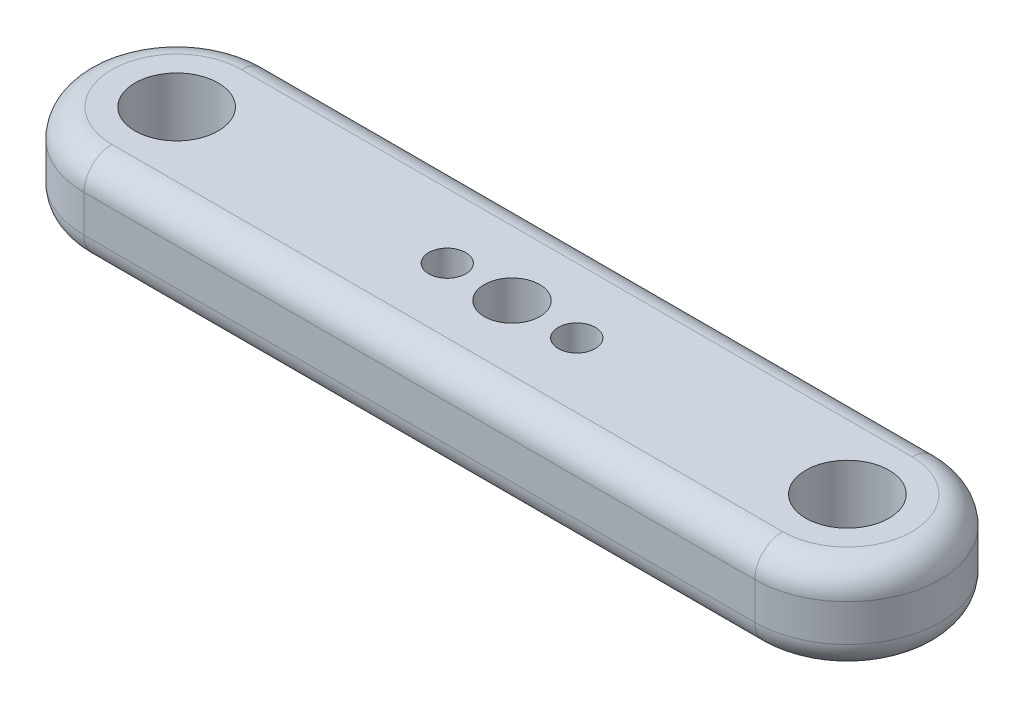
ISO-10303-21;
HEADER;
FILE_DESCRIPTION(('STEP AP214'),'2;1');
FILE_NAME('part.step','',(''),(''),'','','');
FILE_SCHEMA(('AUTOMOTIVE_DESIGN { 1 0 10303 214 1 1 1 1 }'));
ENDSEC;
DATA;
#1=APPLICATION_CONTEXT('core data for automotive mechanical design processes');
#2=APPLICATION_PROTOCOL_DEFINITION('international standard','automotive_design',2000,#1);
#3=PRODUCT_CONTEXT('',#1,'mechanical');
#4=PRODUCT('Part','Part','',(#3));
#5=PRODUCT_RELATED_PRODUCT_CATEGORY('part','',(#4));
#6=PRODUCT_DEFINITION_FORMATION('','',#4);
#7=PRODUCT_DEFINITION_CONTEXT('part definition',#1,'design');
#8=PRODUCT_DEFINITION('design','',#6,#7);
#9=PRODUCT_DEFINITION_SHAPE('','',#8);
#10=(LENGTH_UNIT() NAMED_UNIT(*) SI_UNIT(.MILLI.,.METRE.));
#11=(NAMED_UNIT(*) PLANE_ANGLE_UNIT() SI_UNIT($,.RADIAN.));
#12=(NAMED_UNIT(*) SI_UNIT($,.STERADIAN.) SOLID_ANGLE_UNIT());
#13=UNCERTAINTY_MEASURE_WITH_UNIT(LENGTH_MEASURE(1.E-05),#10,'distance_accuracy_value','');
#14=(GEOMETRIC_REPRESENTATION_CONTEXT(3) GLOBAL_UNCERTAINTY_ASSIGNED_CONTEXT((#13)) GLOBAL_UNIT_ASSIGNED_CONTEXT((#10,
#11,#12)) REPRESENTATION_CONTEXT('',''));
#15=CARTESIAN_POINT('',(0.,0.,0.));
#16=DIRECTION('',(0.,0.,1.));
#17=DIRECTION('',(1.,0.,0.));
#18=AXIS2_PLACEMENT_3D('',#15,#16,#17);
#19=CARTESIAN_POINT('',(0.,10.,10.));
#20=DIRECTION('',(0.,0.,1.));
#21=DIRECTION('',(1.,0.,0.));
#22=AXIS2_PLACEMENT_3D('',#19,#20,#21);
#23=PLANE('',#22);
#24=DIRECTION('',(0.,-1.,0.));
#25=VECTOR('',#24,1.);
#26=CARTESIAN_POINT('',(-36.25,10.,10.));
#27=LINE('',#26,#25);
#28=CARTESIAN_POINT('',(-36.25,7.,10.));
#29=VERTEX_POINT('',#28);
#30=CARTESIAN_POINT('',(-36.25,3.,10.));
#31=VERTEX_POINT('',#30);
#32=EDGE_CURVE('E105',#29,#31,#27,.T.);
#33=ORIENTED_EDGE('',*,*,#32,.T.);
#34=DIRECTION('',(-1.,0.,0.));
#35=VECTOR('',#34,1.);
#36=CARTESIAN_POINT('',(36.25,3.,10.));
#37=LINE('',#36,#35);
#38=CARTESIAN_POINT('',(36.25,3.,10.));
#39=VERTEX_POINT('',#38);
#40=EDGE_CURVE('E111',#31,#39,#37,.F.);
#41=ORIENTED_EDGE('',*,*,#40,.T.);
#42=DIRECTION('',(0.,-1.,0.));
#43=VECTOR('',#42,1.);
#44=CARTESIAN_POINT('',(36.25,10.,10.));
#45=LINE('',#44,#43);
#46=CARTESIAN_POINT('',(36.25,7.,10.));
#47=VERTEX_POINT('',#46);
#48=EDGE_CURVE('E107',#47,#39,#45,.T.);
#49=ORIENTED_EDGE('',*,*,#48,.F.);
#50=DIRECTION('',(-1.,0.,0.));
#51=VECTOR('',#50,1.);
#52=CARTESIAN_POINT('',(0.,7.,10.));
#53=LINE('',#52,#51);
#54=EDGE_CURVE('E103',#47,#29,#53,.T.);
#55=ORIENTED_EDGE('',*,*,#54,.T.);
#56=EDGE_LOOP('',(#33,#41,#49,#55));
#57=FACE_BOUND('',#56,.T.);
#58=ADVANCED_FACE('F34',(#57),#23,.T.);
#59=CARTESIAN_POINT('',(36.25,10.,0.));
#60=DIRECTION('',(0.,-1.,0.));
#61=DIRECTION('',(0.,0.,-1.));
#62=AXIS2_PLACEMENT_3D('',#59,#60,#61);
#63=CYLINDRICAL_SURFACE('',#62,10.);
#64=ORIENTED_EDGE('',*,*,#48,.T.);
#65=CARTESIAN_POINT('',(36.25,3.,0.));
#66=DIRECTION('',(0.,1.,0.));
#67=DIRECTION('',(0.,0.,1.));
#68=AXIS2_PLACEMENT_3D('',#65,#66,#67);
#69=CIRCLE('',#68,10.);
#70=CARTESIAN_POINT('',(36.25,3.,-10.));
#71=VERTEX_POINT('',#70);
#72=EDGE_CURVE('E172',#39,#71,#69,.T.);
#73=ORIENTED_EDGE('',*,*,#72,.T.);
#74=DIRECTION('',(0.,-1.,0.));
#75=VECTOR('',#74,1.);
#76=CARTESIAN_POINT('',(36.25,10.,-10.));
#77=LINE('',#76,#75);
#78=CARTESIAN_POINT('',(36.25,7.,-10.));
#79=VERTEX_POINT('',#78);
#80=EDGE_CURVE('E196',#79,#71,#77,.T.);
#81=ORIENTED_EDGE('',*,*,#80,.F.);
#82=CARTESIAN_POINT('',(36.25,7.,0.));
#83=DIRECTION('',(0.,1.,0.));
#84=DIRECTION('',(0.,0.,1.));
#85=AXIS2_PLACEMENT_3D('',#82,#83,#84);
#86=CIRCLE('',#85,10.);
#87=EDGE_CURVE('E183',#79,#47,#86,.F.);
#88=ORIENTED_EDGE('',*,*,#87,.T.);
#89=EDGE_LOOP('',(#64,#73,#81,#88));
#90=FACE_BOUND('',#89,.T.);
#91=ADVANCED_FACE('F199',(#90),#63,.T.);
#92=CARTESIAN_POINT('',(0.,10.,-10.));
#93=DIRECTION('',(0.,0.,-1.));
#94=DIRECTION('',(-1.,0.,0.));
#95=AXIS2_PLACEMENT_3D('',#92,#93,#94);
#96=PLANE('',#95);
#97=ORIENTED_EDGE('',*,*,#80,.T.);
#98=DIRECTION('',(1.,0.,0.));
#99=VECTOR('',#98,1.);
#100=CARTESIAN_POINT('',(-36.25,3.,-10.));
#101=LINE('',#100,#99);
#102=CARTESIAN_POINT('',(-36.25,3.,-10.));
#103=VERTEX_POINT('',#102);
#104=EDGE_CURVE('E11',#71,#103,#101,.F.);
#105=ORIENTED_EDGE('',*,*,#104,.T.);
#106=DIRECTION('',(0.,-1.,0.));
#107=VECTOR('',#106,1.);
#108=CARTESIAN_POINT('',(-36.25,10.,-10.));
#109=LINE('',#108,#107);
#110=CARTESIAN_POINT('',(-36.25,7.,-10.));
#111=VERTEX_POINT('',#110);
#112=EDGE_CURVE('E123',#111,#103,#109,.T.);
#113=ORIENTED_EDGE('',*,*,#112,.F.);
#114=DIRECTION('',(1.,0.,0.));
#115=VECTOR('',#114,1.);
#116=CARTESIAN_POINT('',(0.,7.,-10.));
#117=LINE('',#116,#115);
#118=EDGE_CURVE('E43',#111,#79,#117,.T.);
#119=ORIENTED_EDGE('',*,*,#118,.T.);
#120=EDGE_LOOP('',(#97,#105,#113,#119));
#121=FACE_BOUND('',#120,.T.);
#122=ADVANCED_FACE('F195',(#121),#96,.T.);
#123=CARTESIAN_POINT('',(-36.25,10.,0.));
#124=DIRECTION('',(0.,-1.,0.));
#125=DIRECTION('',(0.,0.,-1.));
#126=AXIS2_PLACEMENT_3D('',#123,#124,#125);
#127=CYLINDRICAL_SURFACE('',#126,10.);
#128=ORIENTED_EDGE('',*,*,#112,.T.);
#129=CARTESIAN_POINT('',(-36.25,3.,0.));
#130=DIRECTION('',(0.,1.,0.));
#131=DIRECTION('',(0.,0.,1.));
#132=AXIS2_PLACEMENT_3D('',#129,#130,#131);
#133=CIRCLE('',#132,10.);
#134=EDGE_CURVE('E122',#103,#31,#133,.T.);
#135=ORIENTED_EDGE('',*,*,#134,.T.);
#136=ORIENTED_EDGE('',*,*,#32,.F.);
#137=CARTESIAN_POINT('',(-36.25,7.,0.));
#138=DIRECTION('',(0.,1.,0.));
#139=DIRECTION('',(0.,0.,1.));
#140=AXIS2_PLACEMENT_3D('',#137,#138,#139);
#141=CIRCLE('',#140,10.);
#142=EDGE_CURVE('E119',#29,#111,#141,.F.);
#143=ORIENTED_EDGE('',*,*,#142,.T.);
#144=EDGE_LOOP('',(#128,#135,#136,#143));
#145=FACE_BOUND('',#144,.T.);
#146=ADVANCED_FACE('F118',(#145),#127,.T.);
#147=CARTESIAN_POINT('',(0.,10.,0.));
#148=DIRECTION('',(0.,1.,0.));
#149=DIRECTION('',(0.,0.,1.));
#150=AXIS2_PLACEMENT_3D('',#147,#148,#149);
#151=PLANE('',#150);
#152=CARTESIAN_POINT('',(0.,10.,0.));
#153=DIRECTION('',(0.,1.,0.));
#154=DIRECTION('',(0.,0.,1.));
#155=AXIS2_PLACEMENT_3D('',#152,#153,#154);
#156=CIRCLE('',#155,3.);
#157=CARTESIAN_POINT('',(0.,10.,3.));
#158=VERTEX_POINT('',#157);
#159=EDGE_CURVE('E354',#158,#158,#156,.T.);
#160=ORIENTED_EDGE('',*,*,#159,.F.);
#161=EDGE_LOOP('',(#160));
#162=FACE_BOUND('',#161,.T.);
#163=CARTESIAN_POINT('',(-7.,10.,0.));
#164=DIRECTION('',(0.,1.,0.));
#165=DIRECTION('',(0.,0.,1.));
#166=AXIS2_PLACEMENT_3D('',#163,#164,#165);
#167=CIRCLE('',#166,2.);
#168=CARTESIAN_POINT('',(-7.,10.,2.));
#169=VERTEX_POINT('',#168);
#170=EDGE_CURVE('E363',#169,#169,#167,.T.);
#171=ORIENTED_EDGE('',*,*,#170,.F.);
#172=EDGE_LOOP('',(#171));
#173=FACE_BOUND('',#172,.T.);
#174=CARTESIAN_POINT('',(7.,10.,0.));
#175=DIRECTION('',(0.,1.,0.));
#176=DIRECTION('',(0.,0.,1.));
#177=AXIS2_PLACEMENT_3D('',#174,#175,#176);
#178=CIRCLE('',#177,2.);
#179=CARTESIAN_POINT('',(7.,10.,2.));
#180=VERTEX_POINT('',#179);
#181=EDGE_CURVE('E356',#180,#180,#178,.T.);
#182=ORIENTED_EDGE('',*,*,#181,.F.);
#183=EDGE_LOOP('',(#182));
#184=FACE_BOUND('',#183,.T.);
#185=DIRECTION('',(1.,0.,0.));
#186=VECTOR('',#185,1.);
#187=CARTESIAN_POINT('',(0.,10.,-7.));
#188=LINE('',#187,#186);
#189=CARTESIAN_POINT('',(36.25,10.,-7.));
#190=VERTEX_POINT('',#189);
#191=CARTESIAN_POINT('',(-36.25,10.,-7.));
#192=VERTEX_POINT('',#191);
#193=EDGE_CURVE('E186',#190,#192,#188,.F.);
#194=ORIENTED_EDGE('',*,*,#193,.T.);
#195=CARTESIAN_POINT('',(-36.25,10.,0.));
#196=DIRECTION('',(0.,1.,0.));
#197=DIRECTION('',(0.,0.,1.));
#198=AXIS2_PLACEMENT_3D('',#195,#196,#197);
#199=CIRCLE('',#198,7.00000000000001);
#200=CARTESIAN_POINT('',(-36.25,10.,7.00000000000001));
#201=VERTEX_POINT('',#200);
#202=EDGE_CURVE('E191',#192,#201,#199,.T.);
#203=ORIENTED_EDGE('',*,*,#202,.T.);
#204=DIRECTION('',(-1.,0.,0.));
#205=VECTOR('',#204,1.);
#206=CARTESIAN_POINT('',(0.,10.,7.00000000000001));
#207=LINE('',#206,#205);
#208=CARTESIAN_POINT('',(36.25,10.,7.));
#209=VERTEX_POINT('',#208);
#210=EDGE_CURVE('E58',#201,#209,#207,.F.);
#211=ORIENTED_EDGE('',*,*,#210,.T.);
#212=CARTESIAN_POINT('',(36.25,10.,0.));
#213=DIRECTION('',(0.,1.,0.));
#214=DIRECTION('',(0.,0.,1.));
#215=AXIS2_PLACEMENT_3D('',#212,#213,#214);
#216=CIRCLE('',#215,7.);
#217=EDGE_CURVE('E188',#209,#190,#216,.T.);
#218=ORIENTED_EDGE('',*,*,#217,.T.);
#219=EDGE_LOOP('',(#194,#203,#211,#218));
#220=FACE_BOUND('',#219,.T.);
#221=CARTESIAN_POINT('',(-36.25,10.,0.));
#222=DIRECTION('',(0.,1.,0.));
#223=DIRECTION('',(0.,0.,1.));
#224=AXIS2_PLACEMENT_3D('',#221,#222,#223);
#225=CIRCLE('',#224,4.5);
#226=CARTESIAN_POINT('',(-36.25,10.,4.5));
#227=VERTEX_POINT('',#226);
#228=EDGE_CURVE('E137',#227,#227,#225,.T.);
#229=ORIENTED_EDGE('',*,*,#228,.F.);
#230=EDGE_LOOP('',(#229));
#231=FACE_BOUND('',#230,.T.);
#232=CARTESIAN_POINT('',(36.25,10.,0.));
#233=DIRECTION('',(0.,1.,0.));
#234=DIRECTION('',(0.,0.,1.));
#235=AXIS2_PLACEMENT_3D('',#232,#233,#234);
#236=CIRCLE('',#235,4.5);
#237=CARTESIAN_POINT('',(36.25,10.,4.5));
#238=VERTEX_POINT('',#237);
#239=EDGE_CURVE('E362',#238,#238,#236,.T.);
#240=ORIENTED_EDGE('',*,*,#239,.F.);
#241=EDGE_LOOP('',(#240));
#242=FACE_BOUND('',#241,.T.);
#243=ADVANCED_FACE('F202',(#162,#173,#184,#220,#231,#242),#151,.T.);
#244=CARTESIAN_POINT('',(0.,0.,0.));
#245=DIRECTION('',(0.,1.,0.));
#246=DIRECTION('',(0.,0.,1.));
#247=AXIS2_PLACEMENT_3D('',#244,#245,#246);
#248=PLANE('',#247);
#249=CARTESIAN_POINT('',(0.,0.,0.));
#250=DIRECTION('',(0.,1.,0.));
#251=DIRECTION('',(0.,0.,1.));
#252=AXIS2_PLACEMENT_3D('',#249,#250,#251);
#253=CIRCLE('',#252,3.);
#254=CARTESIAN_POINT('',(0.,0.,3.));
#255=VERTEX_POINT('',#254);
#256=EDGE_CURVE('E351',#255,#255,#253,.T.);
#257=ORIENTED_EDGE('',*,*,#256,.T.);
#258=EDGE_LOOP('',(#257));
#259=FACE_BOUND('',#258,.T.);
#260=CARTESIAN_POINT('',(-7.,0.,0.));
#261=DIRECTION('',(0.,1.,0.));
#262=DIRECTION('',(0.,0.,1.));
#263=AXIS2_PLACEMENT_3D('',#260,#261,#262);
#264=CIRCLE('',#263,2.);
#265=CARTESIAN_POINT('',(-7.,0.,2.));
#266=VERTEX_POINT('',#265);
#267=EDGE_CURVE('E359',#266,#266,#264,.T.);
#268=ORIENTED_EDGE('',*,*,#267,.T.);
#269=EDGE_LOOP('',(#268));
#270=FACE_BOUND('',#269,.T.);
#271=CARTESIAN_POINT('',(7.,0.,0.));
#272=DIRECTION('',(0.,1.,0.));
#273=DIRECTION('',(0.,0.,1.));
#274=AXIS2_PLACEMENT_3D('',#271,#272,#273);
#275=CIRCLE('',#274,2.);
#276=CARTESIAN_POINT('',(7.,0.,2.));
#277=VERTEX_POINT('',#276);
#278=EDGE_CURVE('E366',#277,#277,#275,.T.);
#279=ORIENTED_EDGE('',*,*,#278,.T.);
#280=EDGE_LOOP('',(#279));
#281=FACE_BOUND('',#280,.T.);
#282=DIRECTION('',(-1.,0.,0.));
#283=VECTOR('',#282,1.);
#284=CARTESIAN_POINT('',(-36.25,0.,7.00000000000001));
#285=LINE('',#284,#283);
#286=CARTESIAN_POINT('',(36.25,0.,7.));
#287=VERTEX_POINT('',#286);
#288=CARTESIAN_POINT('',(-36.25,0.,7.00000000000001));
#289=VERTEX_POINT('',#288);
#290=EDGE_CURVE('E175',#287,#289,#285,.T.);
#291=ORIENTED_EDGE('',*,*,#290,.T.);
#292=CARTESIAN_POINT('',(-36.25,0.,0.));
#293=DIRECTION('',(0.,1.,0.));
#294=DIRECTION('',(0.,0.,1.));
#295=AXIS2_PLACEMENT_3D('',#292,#293,#294);
#296=CIRCLE('',#295,7.00000000000001);
#297=CARTESIAN_POINT('',(-36.25,0.,-7.));
#298=VERTEX_POINT('',#297);
#299=EDGE_CURVE('E112',#289,#298,#296,.F.);
#300=ORIENTED_EDGE('',*,*,#299,.T.);
#301=DIRECTION('',(1.,0.,0.));
#302=VECTOR('',#301,1.);
#303=CARTESIAN_POINT('',(36.25,0.,-7.));
#304=LINE('',#303,#302);
#305=CARTESIAN_POINT('',(36.25,0.,-7.));
#306=VERTEX_POINT('',#305);
#307=EDGE_CURVE('E166',#298,#306,#304,.T.);
#308=ORIENTED_EDGE('',*,*,#307,.T.);
#309=CARTESIAN_POINT('',(36.25,0.,0.));
#310=DIRECTION('',(0.,1.,0.));
#311=DIRECTION('',(0.,0.,1.));
#312=AXIS2_PLACEMENT_3D('',#309,#310,#311);
#313=CIRCLE('',#312,7.);
#314=EDGE_CURVE('E173',#306,#287,#313,.F.);
#315=ORIENTED_EDGE('',*,*,#314,.T.);
#316=EDGE_LOOP('',(#291,#300,#308,#315));
#317=FACE_BOUND('',#316,.T.);
#318=CARTESIAN_POINT('',(-36.25,0.,0.));
#319=DIRECTION('',(0.,1.,0.));
#320=DIRECTION('',(0.,0.,1.));
#321=AXIS2_PLACEMENT_3D('',#318,#319,#320);
#322=CIRCLE('',#321,4.5);
#323=CARTESIAN_POINT('',(-36.25,0.,4.5));
#324=VERTEX_POINT('',#323);
#325=EDGE_CURVE('E132',#324,#324,#322,.F.);
#326=ORIENTED_EDGE('',*,*,#325,.F.);
#327=EDGE_LOOP('',(#326));
#328=FACE_BOUND('',#327,.T.);
#329=CARTESIAN_POINT('',(36.25,0.,0.));
#330=DIRECTION('',(0.,1.,0.));
#331=DIRECTION('',(0.,0.,1.));
#332=AXIS2_PLACEMENT_3D('',#329,#330,#331);
#333=CIRCLE('',#332,4.5);
#334=CARTESIAN_POINT('',(36.25,0.,4.5));
#335=VERTEX_POINT('',#334);
#336=EDGE_CURVE('E373',#335,#335,#333,.F.);
#337=ORIENTED_EDGE('',*,*,#336,.F.);
#338=EDGE_LOOP('',(#337));
#339=FACE_BOUND('',#338,.T.);
#340=ADVANCED_FACE('F229',(#259,#270,#281,#317,#328,#339),#248,.F.);
#341=CARTESIAN_POINT('',(36.25,3.,0.));
#342=DIRECTION('',(0.,1.,0.));
#343=DIRECTION('',(0.,0.,1.));
#344=AXIS2_PLACEMENT_3D('',#341,#342,#343);
#345=TOROIDAL_SURFACE('',#344,7.,3.);
#346=CARTESIAN_POINT('',(36.25,3.,7.));
#347=DIRECTION('',(-1.,0.,0.));
#348=DIRECTION('',(0.,0.,1.));
#349=AXIS2_PLACEMENT_3D('',#346,#347,#348);
#350=CIRCLE('',#349,3.);
#351=EDGE_CURVE('E152',#287,#39,#350,.T.);
#352=ORIENTED_EDGE('',*,*,#351,.F.);
#353=ORIENTED_EDGE('',*,*,#314,.F.);
#354=CARTESIAN_POINT('',(36.25,3.,-7.));
#355=DIRECTION('',(-1.,0.,0.));
#356=DIRECTION('',(0.,0.,1.));
#357=AXIS2_PLACEMENT_3D('',#354,#355,#356);
#358=CIRCLE('',#357,3.);
#359=EDGE_CURVE('E124',#71,#306,#358,.T.);
#360=ORIENTED_EDGE('',*,*,#359,.F.);
#361=ORIENTED_EDGE('',*,*,#72,.F.);
#362=EDGE_LOOP('',(#352,#353,#360,#361));
#363=FACE_BOUND('',#362,.T.);
#364=ADVANCED_FACE('F171',(#363),#345,.T.);
#365=CARTESIAN_POINT('',(0.,3.,-7.));
#366=DIRECTION('',(-1.,0.,0.));
#367=DIRECTION('',(0.,0.,1.));
#368=AXIS2_PLACEMENT_3D('',#365,#366,#367);
#369=CYLINDRICAL_SURFACE('',#368,3.);
#370=ORIENTED_EDGE('',*,*,#359,.T.);
#371=ORIENTED_EDGE('',*,*,#307,.F.);
#372=CARTESIAN_POINT('',(-36.25,3.,-7.));
#373=DIRECTION('',(-1.,0.,0.));
#374=DIRECTION('',(0.,0.,1.));
#375=AXIS2_PLACEMENT_3D('',#372,#373,#374);
#376=CIRCLE('',#375,3.);
#377=EDGE_CURVE('E146',#103,#298,#376,.T.);
#378=ORIENTED_EDGE('',*,*,#377,.F.);
#379=ORIENTED_EDGE('',*,*,#104,.F.);
#380=EDGE_LOOP('',(#370,#371,#378,#379));
#381=FACE_BOUND('',#380,.T.);
#382=ADVANCED_FACE('F164',(#381),#369,.T.);
#383=CARTESIAN_POINT('',(0.,3.,7.00000000000001));
#384=DIRECTION('',(1.,0.,0.));
#385=DIRECTION('',(0.,0.,-1.));
#386=AXIS2_PLACEMENT_3D('',#383,#384,#385);
#387=CYLINDRICAL_SURFACE('',#386,3.);
#388=ORIENTED_EDGE('',*,*,#351,.T.);
#389=ORIENTED_EDGE('',*,*,#40,.F.);
#390=CARTESIAN_POINT('',(-36.25,3.,7.00000000000001));
#391=DIRECTION('',(-1.,0.,0.));
#392=DIRECTION('',(0.,0.,1.));
#393=AXIS2_PLACEMENT_3D('',#390,#391,#392);
#394=CIRCLE('',#393,3.);
#395=EDGE_CURVE('E142',#289,#31,#394,.T.);
#396=ORIENTED_EDGE('',*,*,#395,.F.);
#397=ORIENTED_EDGE('',*,*,#290,.F.);
#398=EDGE_LOOP('',(#388,#389,#396,#397));
#399=FACE_BOUND('',#398,.T.);
#400=ADVANCED_FACE('F222',(#399),#387,.T.);
#401=CARTESIAN_POINT('',(-36.25,3.,0.));
#402=DIRECTION('',(0.,1.,0.));
#403=DIRECTION('',(0.,0.,1.));
#404=AXIS2_PLACEMENT_3D('',#401,#402,#403);
#405=TOROIDAL_SURFACE('',#404,7.00000000000001,3.);
#406=ORIENTED_EDGE('',*,*,#377,.T.);
#407=ORIENTED_EDGE('',*,*,#299,.F.);
#408=ORIENTED_EDGE('',*,*,#395,.T.);
#409=ORIENTED_EDGE('',*,*,#134,.F.);
#410=EDGE_LOOP('',(#406,#407,#408,#409));
#411=FACE_BOUND('',#410,.T.);
#412=ADVANCED_FACE('F211',(#411),#405,.T.);
#413=CARTESIAN_POINT('',(36.25,7.,0.));
#414=DIRECTION('',(0.,1.,0.));
#415=DIRECTION('',(0.,0.,1.));
#416=AXIS2_PLACEMENT_3D('',#413,#414,#415);
#417=TOROIDAL_SURFACE('',#416,7.,3.);
#418=CARTESIAN_POINT('',(36.25,7.,7.));
#419=DIRECTION('',(-1.,0.,0.));
#420=DIRECTION('',(0.,0.,1.));
#421=AXIS2_PLACEMENT_3D('',#418,#419,#420);
#422=CIRCLE('',#421,3.);
#423=EDGE_CURVE('E134',#47,#209,#422,.T.);
#424=ORIENTED_EDGE('',*,*,#423,.F.);
#425=ORIENTED_EDGE('',*,*,#87,.F.);
#426=CARTESIAN_POINT('',(36.25,7.,-7.));
#427=DIRECTION('',(-1.,0.,0.));
#428=DIRECTION('',(0.,0.,1.));
#429=AXIS2_PLACEMENT_3D('',#426,#427,#428);
#430=CIRCLE('',#429,3.);
#431=EDGE_CURVE('E38',#190,#79,#430,.T.);
#432=ORIENTED_EDGE('',*,*,#431,.F.);
#433=ORIENTED_EDGE('',*,*,#217,.F.);
#434=EDGE_LOOP('',(#424,#425,#432,#433));
#435=FACE_BOUND('',#434,.T.);
#436=ADVANCED_FACE('F36',(#435),#417,.T.);
#437=CARTESIAN_POINT('',(0.,7.,-7.));
#438=DIRECTION('',(1.,0.,0.));
#439=DIRECTION('',(0.,0.,-1.));
#440=AXIS2_PLACEMENT_3D('',#437,#438,#439);
#441=CYLINDRICAL_SURFACE('',#440,3.);
#442=ORIENTED_EDGE('',*,*,#431,.T.);
#443=ORIENTED_EDGE('',*,*,#118,.F.);
#444=CARTESIAN_POINT('',(-36.25,7.,-7.));
#445=DIRECTION('',(-1.,0.,0.));
#446=DIRECTION('',(0.,0.,1.));
#447=AXIS2_PLACEMENT_3D('',#444,#445,#446);
#448=CIRCLE('',#447,3.);
#449=EDGE_CURVE('E128',#192,#111,#448,.T.);
#450=ORIENTED_EDGE('',*,*,#449,.F.);
#451=ORIENTED_EDGE('',*,*,#193,.F.);
#452=EDGE_LOOP('',(#442,#443,#450,#451));
#453=FACE_BOUND('',#452,.T.);
#454=ADVANCED_FACE('F204',(#453),#441,.T.);
#455=CARTESIAN_POINT('',(0.,7.,7.00000000000001));
#456=DIRECTION('',(-1.,0.,0.));
#457=DIRECTION('',(0.,0.,1.));
#458=AXIS2_PLACEMENT_3D('',#455,#456,#457);
#459=CYLINDRICAL_SURFACE('',#458,3.);
#460=ORIENTED_EDGE('',*,*,#423,.T.);
#461=ORIENTED_EDGE('',*,*,#210,.F.);
#462=CARTESIAN_POINT('',(-36.25,7.,7.00000000000001));
#463=DIRECTION('',(-1.,0.,0.));
#464=DIRECTION('',(0.,0.,1.));
#465=AXIS2_PLACEMENT_3D('',#462,#463,#464);
#466=CIRCLE('',#465,3.);
#467=EDGE_CURVE('E51',#29,#201,#466,.T.);
#468=ORIENTED_EDGE('',*,*,#467,.F.);
#469=ORIENTED_EDGE('',*,*,#54,.F.);
#470=EDGE_LOOP('',(#460,#461,#468,#469));
#471=FACE_BOUND('',#470,.T.);
#472=ADVANCED_FACE('F131',(#471),#459,.T.);
#473=CARTESIAN_POINT('',(-36.25,7.,0.));
#474=DIRECTION('',(0.,1.,0.));
#475=DIRECTION('',(0.,0.,1.));
#476=AXIS2_PLACEMENT_3D('',#473,#474,#475);
#477=TOROIDAL_SURFACE('',#476,7.00000000000001,3.);
#478=ORIENTED_EDGE('',*,*,#449,.T.);
#479=ORIENTED_EDGE('',*,*,#142,.F.);
#480=ORIENTED_EDGE('',*,*,#467,.T.);
#481=ORIENTED_EDGE('',*,*,#202,.F.);
#482=EDGE_LOOP('',(#478,#479,#480,#481));
#483=FACE_BOUND('',#482,.T.);
#484=ADVANCED_FACE('F126',(#483),#477,.T.);
#485=CARTESIAN_POINT('',(-36.25,-14.142135623731,0.));
#486=DIRECTION('',(0.,1.,0.));
#487=DIRECTION('',(0.,0.,1.));
#488=AXIS2_PLACEMENT_3D('',#485,#486,#487);
#489=CYLINDRICAL_SURFACE('',#488,4.5);
#490=ORIENTED_EDGE('',*,*,#325,.T.);
#491=EDGE_LOOP('',(#490));
#492=FACE_BOUND('',#491,.T.);
#493=ORIENTED_EDGE('',*,*,#228,.T.);
#494=EDGE_LOOP('',(#493));
#495=FACE_BOUND('',#494,.T.);
#496=ADVANCED_FACE('F231',(#492,#495),#489,.F.);
#497=CARTESIAN_POINT('',(36.25,-14.142135623731,0.));
#498=DIRECTION('',(0.,1.,0.));
#499=DIRECTION('',(0.,0.,1.));
#500=AXIS2_PLACEMENT_3D('',#497,#498,#499);
#501=CYLINDRICAL_SURFACE('',#500,4.5);
#502=ORIENTED_EDGE('',*,*,#336,.T.);
#503=EDGE_LOOP('',(#502));
#504=FACE_BOUND('',#503,.T.);
#505=ORIENTED_EDGE('',*,*,#239,.T.);
#506=EDGE_LOOP('',(#505));
#507=FACE_BOUND('',#506,.T.);
#508=ADVANCED_FACE('F235',(#504,#507),#501,.F.);
#509=CARTESIAN_POINT('',(7.,0.,0.));
#510=DIRECTION('',(0.,1.,0.));
#511=DIRECTION('',(0.,0.,1.));
#512=AXIS2_PLACEMENT_3D('',#509,#510,#511);
#513=CYLINDRICAL_SURFACE('',#512,2.);
#514=ORIENTED_EDGE('',*,*,#278,.F.);
#515=EDGE_LOOP('',(#514));
#516=FACE_BOUND('',#515,.T.);
#517=ORIENTED_EDGE('',*,*,#181,.T.);
#518=EDGE_LOOP('',(#517));
#519=FACE_BOUND('',#518,.T.);
#520=ADVANCED_FACE('F241',(#516,#519),#513,.F.);
#521=CARTESIAN_POINT('',(-7.,0.,0.));
#522=DIRECTION('',(0.,1.,0.));
#523=DIRECTION('',(0.,0.,1.));
#524=AXIS2_PLACEMENT_3D('',#521,#522,#523);
#525=CYLINDRICAL_SURFACE('',#524,2.);
#526=ORIENTED_EDGE('',*,*,#267,.F.);
#527=EDGE_LOOP('',(#526));
#528=FACE_BOUND('',#527,.T.);
#529=ORIENTED_EDGE('',*,*,#170,.T.);
#530=EDGE_LOOP('',(#529));
#531=FACE_BOUND('',#530,.T.);
#532=ADVANCED_FACE('F326',(#528,#531),#525,.F.);
#533=CARTESIAN_POINT('',(0.,0.,0.));
#534=DIRECTION('',(0.,1.,0.));
#535=DIRECTION('',(0.,0.,1.));
#536=AXIS2_PLACEMENT_3D('',#533,#534,#535);
#537=CYLINDRICAL_SURFACE('',#536,3.);
#538=ORIENTED_EDGE('',*,*,#256,.F.);
#539=EDGE_LOOP('',(#538));
#540=FACE_BOUND('',#539,.T.);
#541=ORIENTED_EDGE('',*,*,#159,.T.);
#542=EDGE_LOOP('',(#541));
#543=FACE_BOUND('',#542,.T.);
#544=ADVANCED_FACE('F334',(#540,#543),#537,.F.);
#545=CLOSED_SHELL('',(#58,#91,#122,#146,#243,#340,#364,#382,#400,#412,#436,#454,#472,#484,#496,
#508,#520,#532,#544));
#546=MANIFOLD_SOLID_BREP('B2',#545);
#547=ADVANCED_BREP_SHAPE_REPRESENTATION('',(#18,#546),#14);
#548=SHAPE_DEFINITION_REPRESENTATION(#9,#547);
ENDSEC;
END-ISO-10303-21;
